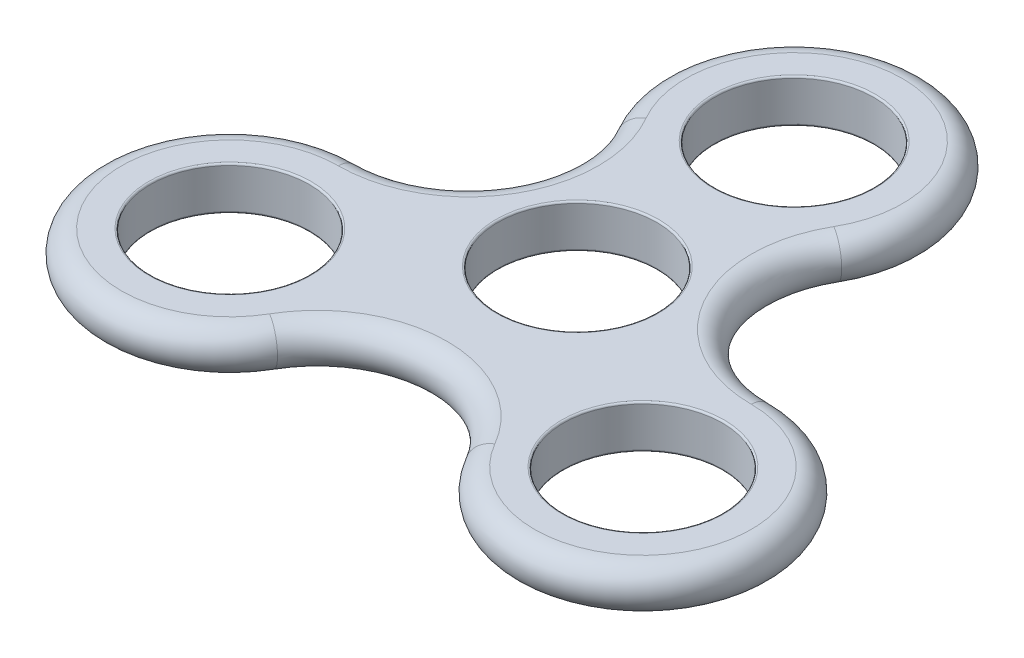
ISO-10303-21;
HEADER;
FILE_DESCRIPTION(('STEP AP214'),'2;1');
FILE_NAME('part.step','',(''),(''),'','','');
FILE_SCHEMA(('AUTOMOTIVE_DESIGN { 1 0 10303 214 1 1 1 1 }'));
ENDSEC;
DATA;
#1=APPLICATION_CONTEXT('core data for automotive mechanical design processes');
#2=APPLICATION_PROTOCOL_DEFINITION('international standard','automotive_design',2000,#1);
#3=PRODUCT_CONTEXT('',#1,'mechanical');
#4=PRODUCT('Part','Part','',(#3));
#5=PRODUCT_RELATED_PRODUCT_CATEGORY('part','',(#4));
#6=PRODUCT_DEFINITION_FORMATION('','',#4);
#7=PRODUCT_DEFINITION_CONTEXT('part definition',#1,'design');
#8=PRODUCT_DEFINITION('design','',#6,#7);
#9=PRODUCT_DEFINITION_SHAPE('','',#8);
#10=(LENGTH_UNIT() NAMED_UNIT(*) SI_UNIT(.MILLI.,.METRE.));
#11=(NAMED_UNIT(*) PLANE_ANGLE_UNIT() SI_UNIT($,.RADIAN.));
#12=(NAMED_UNIT(*) SI_UNIT($,.STERADIAN.) SOLID_ANGLE_UNIT());
#13=UNCERTAINTY_MEASURE_WITH_UNIT(LENGTH_MEASURE(1.E-05),#10,'distance_accuracy_value','');
#14=(GEOMETRIC_REPRESENTATION_CONTEXT(3) GLOBAL_UNCERTAINTY_ASSIGNED_CONTEXT((#13)) GLOBAL_UNIT_ASSIGNED_CONTEXT((#10,
#11,#12)) REPRESENTATION_CONTEXT('',''));
#15=CARTESIAN_POINT('',(0.,0.,0.));
#16=DIRECTION('',(0.,0.,1.));
#17=DIRECTION('',(1.,0.,0.));
#18=AXIS2_PLACEMENT_3D('',#15,#16,#17);
#19=CARTESIAN_POINT('',(0.,3.,-30.));
#20=DIRECTION('',(0.,1.,0.));
#21=DIRECTION('',(0.,0.,1.));
#22=AXIS2_PLACEMENT_3D('',#19,#20,#21);
#23=TOROIDAL_SURFACE('',#22,15.,3.);
#24=CARTESIAN_POINT('',(-12.9903810567666,3.,-22.5));
#25=DIRECTION('',(0.500000000000002,0.,0.866025403784438));
#26=DIRECTION('',(0.866025403784438,0.,-0.500000000000002));
#27=AXIS2_PLACEMENT_3D('',#24,#25,#26);
#28=CIRCLE('',#27,3.);
#29=CARTESIAN_POINT('',(-12.9903810567666,6.,-22.5));
#30=VERTEX_POINT('',#29);
#31=CARTESIAN_POINT('',(-12.9903810567666,0.,-22.5));
#32=VERTEX_POINT('',#31);
#33=EDGE_CURVE('E107',#30,#32,#28,.T.);
#34=ORIENTED_EDGE('',*,*,#33,.F.);
#35=CARTESIAN_POINT('',(0.,6.,-30.));
#36=DIRECTION('',(0.,-1.,0.));
#37=DIRECTION('',(0.,0.,-1.));
#38=AXIS2_PLACEMENT_3D('',#35,#36,#37);
#39=CIRCLE('',#38,15.);
#40=CARTESIAN_POINT('',(12.9903810567666,6.,-22.5));
#41=VERTEX_POINT('',#40);
#42=EDGE_CURVE('E115',#41,#30,#39,.F.);
#43=ORIENTED_EDGE('',*,*,#42,.F.);
#44=CARTESIAN_POINT('',(12.9903810567666,3.,-22.5));
#45=DIRECTION('',(0.500000000000001,0.,-0.866025403784438));
#46=DIRECTION('',(-0.866025403784438,0.,-0.500000000000001));
#47=AXIS2_PLACEMENT_3D('',#44,#45,#46);
#48=CIRCLE('',#47,3.);
#49=CARTESIAN_POINT('',(12.9903810567666,0.,-22.5));
#50=VERTEX_POINT('',#49);
#51=EDGE_CURVE('E96',#41,#50,#48,.T.);
#52=ORIENTED_EDGE('',*,*,#51,.T.);
#53=CARTESIAN_POINT('',(0.,0.,-30.));
#54=DIRECTION('',(0.,-1.,0.));
#55=DIRECTION('',(0.,0.,-1.));
#56=AXIS2_PLACEMENT_3D('',#53,#54,#55);
#57=CIRCLE('',#56,15.);
#58=EDGE_CURVE('E137',#32,#50,#57,.T.);
#59=ORIENTED_EDGE('',*,*,#58,.F.);
#60=EDGE_LOOP('',(#34,#43,#52,#59));
#61=FACE_BOUND('',#60,.T.);
#62=ADVANCED_FACE('F41',(#61),#23,.T.);
#63=CARTESIAN_POINT('',(28.5788383248865,3.,-13.5));
#64=DIRECTION('',(0.,-1.,0.));
#65=DIRECTION('',(0.,0.,-1.));
#66=AXIS2_PLACEMENT_3D('',#63,#64,#65);
#67=TOROIDAL_SURFACE('',#66,18.,3.);
#68=ORIENTED_EDGE('',*,*,#51,.F.);
#69=CARTESIAN_POINT('',(28.5788383248865,6.,-13.5));
#70=DIRECTION('',(0.,-1.,0.));
#71=DIRECTION('',(0.,0.,-1.));
#72=AXIS2_PLACEMENT_3D('',#69,#70,#71);
#73=CIRCLE('',#72,18.);
#74=CARTESIAN_POINT('',(28.5788383248865,6.,4.50000000000004));
#75=VERTEX_POINT('',#74);
#76=EDGE_CURVE('E99',#75,#41,#73,.T.);
#77=ORIENTED_EDGE('',*,*,#76,.F.);
#78=CARTESIAN_POINT('',(28.5788383248865,3.,4.50000000000004));
#79=DIRECTION('',(-1.,0.,0.));
#80=DIRECTION('',(0.,-1.,0.));
#81=AXIS2_PLACEMENT_3D('',#78,#79,#80);
#82=CIRCLE('',#81,3.);
#83=CARTESIAN_POINT('',(28.5788383248865,0.,4.50000000000004));
#84=VERTEX_POINT('',#83);
#85=EDGE_CURVE('E108',#75,#84,#82,.T.);
#86=ORIENTED_EDGE('',*,*,#85,.T.);
#87=CARTESIAN_POINT('',(28.5788383248865,0.,-13.5));
#88=DIRECTION('',(0.,-1.,0.));
#89=DIRECTION('',(0.,0.,-1.));
#90=AXIS2_PLACEMENT_3D('',#87,#88,#89);
#91=CIRCLE('',#90,18.);
#92=EDGE_CURVE('E101',#50,#84,#91,.F.);
#93=ORIENTED_EDGE('',*,*,#92,.F.);
#94=EDGE_LOOP('',(#68,#77,#86,#93));
#95=FACE_BOUND('',#94,.T.);
#96=ADVANCED_FACE('F98',(#95),#67,.T.);
#97=CARTESIAN_POINT('',(28.5788383248865,3.,19.5));
#98=DIRECTION('',(0.,1.,0.));
#99=DIRECTION('',(0.,0.,1.));
#100=AXIS2_PLACEMENT_3D('',#97,#98,#99);
#101=TOROIDAL_SURFACE('',#100,15.,3.);
#102=ORIENTED_EDGE('',*,*,#85,.F.);
#103=CARTESIAN_POINT('',(28.5788383248865,6.,19.5));
#104=DIRECTION('',(0.,-1.,0.));
#105=DIRECTION('',(0.,0.,-1.));
#106=AXIS2_PLACEMENT_3D('',#103,#104,#105);
#107=CIRCLE('',#106,15.);
#108=CARTESIAN_POINT('',(15.5884572681199,6.,27.));
#109=VERTEX_POINT('',#108);
#110=EDGE_CURVE('E118',#109,#75,#107,.F.);
#111=ORIENTED_EDGE('',*,*,#110,.F.);
#112=CARTESIAN_POINT('',(15.5884572681199,3.,27.));
#113=DIRECTION('',(0.499999999999999,0.,0.866025403784439));
#114=DIRECTION('',(0.866025403784439,0.,-0.499999999999999));
#115=AXIS2_PLACEMENT_3D('',#112,#113,#114);
#116=CIRCLE('',#115,3.);
#117=CARTESIAN_POINT('',(15.5884572681199,0.,27.));
#118=VERTEX_POINT('',#117);
#119=EDGE_CURVE('E162',#109,#118,#116,.T.);
#120=ORIENTED_EDGE('',*,*,#119,.T.);
#121=CARTESIAN_POINT('',(28.5788383248865,0.,19.5));
#122=DIRECTION('',(0.,-1.,0.));
#123=DIRECTION('',(0.,0.,-1.));
#124=AXIS2_PLACEMENT_3D('',#121,#122,#123);
#125=CIRCLE('',#124,15.);
#126=EDGE_CURVE('E142',#84,#118,#125,.T.);
#127=ORIENTED_EDGE('',*,*,#126,.F.);
#128=EDGE_LOOP('',(#102,#111,#120,#127));
#129=FACE_BOUND('',#128,.T.);
#130=ADVANCED_FACE('F244',(#129),#101,.T.);
#131=CARTESIAN_POINT('',(0.,3.,36.));
#132=DIRECTION('',(0.,-1.,0.));
#133=DIRECTION('',(0.,0.,-1.));
#134=AXIS2_PLACEMENT_3D('',#131,#132,#133);
#135=TOROIDAL_SURFACE('',#134,18.,3.);
#136=ORIENTED_EDGE('',*,*,#119,.F.);
#137=CARTESIAN_POINT('',(0.,6.,36.));
#138=DIRECTION('',(0.,-1.,0.));
#139=DIRECTION('',(0.,0.,-1.));
#140=AXIS2_PLACEMENT_3D('',#137,#138,#139);
#141=CIRCLE('',#140,18.);
#142=CARTESIAN_POINT('',(-15.5884572681199,6.,27.));
#143=VERTEX_POINT('',#142);
#144=EDGE_CURVE('E127',#143,#109,#141,.T.);
#145=ORIENTED_EDGE('',*,*,#144,.F.);
#146=CARTESIAN_POINT('',(-15.5884572681199,3.,27.));
#147=DIRECTION('',(0.499999999999999,0.,-0.866025403784439));
#148=DIRECTION('',(-0.866025403784439,0.,-0.499999999999999));
#149=AXIS2_PLACEMENT_3D('',#146,#147,#148);
#150=CIRCLE('',#149,3.);
#151=CARTESIAN_POINT('',(-15.5884572681199,0.,27.));
#152=VERTEX_POINT('',#151);
#153=EDGE_CURVE('E65',#143,#152,#150,.T.);
#154=ORIENTED_EDGE('',*,*,#153,.T.);
#155=CARTESIAN_POINT('',(0.,0.,36.));
#156=DIRECTION('',(0.,-1.,0.));
#157=DIRECTION('',(0.,0.,-1.));
#158=AXIS2_PLACEMENT_3D('',#155,#156,#157);
#159=CIRCLE('',#158,18.);
#160=EDGE_CURVE('E146',#118,#152,#159,.F.);
#161=ORIENTED_EDGE('',*,*,#160,.F.);
#162=EDGE_LOOP('',(#136,#145,#154,#161));
#163=FACE_BOUND('',#162,.T.);
#164=ADVANCED_FACE('F314',(#163),#135,.T.);
#165=CARTESIAN_POINT('',(-28.5788383248865,3.,19.5));
#166=DIRECTION('',(0.,1.,0.));
#167=DIRECTION('',(0.,0.,1.));
#168=AXIS2_PLACEMENT_3D('',#165,#166,#167);
#169=TOROIDAL_SURFACE('',#168,15.,3.);
#170=ORIENTED_EDGE('',*,*,#153,.F.);
#171=CARTESIAN_POINT('',(-28.5788383248865,6.,19.5));
#172=DIRECTION('',(0.,-1.,0.));
#173=DIRECTION('',(0.,0.,-1.));
#174=AXIS2_PLACEMENT_3D('',#171,#172,#173);
#175=CIRCLE('',#174,15.);
#176=CARTESIAN_POINT('',(-28.5788383248865,6.,4.50000000000003));
#177=VERTEX_POINT('',#176);
#178=EDGE_CURVE('E130',#177,#143,#175,.F.);
#179=ORIENTED_EDGE('',*,*,#178,.F.);
#180=CARTESIAN_POINT('',(-28.5788383248865,3.,4.50000000000003));
#181=DIRECTION('',(-1.,0.,0.));
#182=DIRECTION('',(0.,0.,1.));
#183=AXIS2_PLACEMENT_3D('',#180,#181,#182);
#184=CIRCLE('',#183,3.);
#185=CARTESIAN_POINT('',(-28.5788383248865,0.,4.50000000000003));
#186=VERTEX_POINT('',#185);
#187=EDGE_CURVE('E57',#177,#186,#184,.T.);
#188=ORIENTED_EDGE('',*,*,#187,.T.);
#189=CARTESIAN_POINT('',(-28.5788383248865,0.,19.5));
#190=DIRECTION('',(0.,-1.,0.));
#191=DIRECTION('',(0.,0.,-1.));
#192=AXIS2_PLACEMENT_3D('',#189,#190,#191);
#193=CIRCLE('',#192,15.);
#194=EDGE_CURVE('E150',#152,#186,#193,.T.);
#195=ORIENTED_EDGE('',*,*,#194,.F.);
#196=EDGE_LOOP('',(#170,#179,#188,#195));
#197=FACE_BOUND('',#196,.T.);
#198=ADVANCED_FACE('F307',(#197),#169,.T.);
#199=CARTESIAN_POINT('',(-28.5788383248865,3.,-13.5));
#200=DIRECTION('',(0.,-1.,0.));
#201=DIRECTION('',(0.,0.,-1.));
#202=AXIS2_PLACEMENT_3D('',#199,#200,#201);
#203=TOROIDAL_SURFACE('',#202,18.,3.);
#204=CARTESIAN_POINT('',(-28.5788383248865,6.,-13.5));
#205=DIRECTION('',(0.,-1.,0.));
#206=DIRECTION('',(0.,0.,-1.));
#207=AXIS2_PLACEMENT_3D('',#204,#205,#206);
#208=CIRCLE('',#207,18.);
#209=EDGE_CURVE('E134',#30,#177,#208,.T.);
#210=ORIENTED_EDGE('',*,*,#209,.F.);
#211=ORIENTED_EDGE('',*,*,#33,.T.);
#212=CARTESIAN_POINT('',(-28.5788383248865,0.,-13.5));
#213=DIRECTION('',(0.,-1.,0.));
#214=DIRECTION('',(0.,0.,-1.));
#215=AXIS2_PLACEMENT_3D('',#212,#213,#214);
#216=CIRCLE('',#215,18.);
#217=EDGE_CURVE('E154',#186,#32,#216,.F.);
#218=ORIENTED_EDGE('',*,*,#217,.F.);
#219=ORIENTED_EDGE('',*,*,#187,.F.);
#220=EDGE_LOOP('',(#210,#211,#218,#219));
#221=FACE_BOUND('',#220,.T.);
#222=ADVANCED_FACE('F298',(#221),#203,.T.);
#223=CARTESIAN_POINT('',(-28.5788383248865,6.,3.00000000000003));
#224=DIRECTION('',(0.,-1.,0.));
#225=DIRECTION('',(0.,0.,-1.));
#226=AXIS2_PLACEMENT_3D('',#223,#224,#225);
#227=PLANE('',#226);
#228=CARTESIAN_POINT('',(-28.5788383248865,6.,19.5));
#229=DIRECTION('',(0.,-1.,0.));
#230=DIRECTION('',(0.,0.,-1.));
#231=AXIS2_PLACEMENT_3D('',#228,#229,#230);
#232=CIRCLE('',#231,11.25);
#233=CARTESIAN_POINT('',(-28.5788383248865,6.,8.25000000000003));
#234=VERTEX_POINT('',#233);
#235=EDGE_CURVE('E205',#234,#234,#232,.T.);
#236=ORIENTED_EDGE('',*,*,#235,.T.);
#237=EDGE_LOOP('',(#236));
#238=FACE_BOUND('',#237,.T.);
#239=CARTESIAN_POINT('',(28.5788383248865,6.,19.5));
#240=DIRECTION('',(0.,-1.,0.));
#241=DIRECTION('',(0.,0.,-1.));
#242=AXIS2_PLACEMENT_3D('',#239,#240,#241);
#243=CIRCLE('',#242,11.25);
#244=CARTESIAN_POINT('',(28.5788383248865,6.,8.25000000000003));
#245=VERTEX_POINT('',#244);
#246=EDGE_CURVE('E201',#245,#245,#243,.T.);
#247=ORIENTED_EDGE('',*,*,#246,.T.);
#248=EDGE_LOOP('',(#247));
#249=FACE_BOUND('',#248,.T.);
#250=CARTESIAN_POINT('',(0.,6.,0.));
#251=DIRECTION('',(0.,-1.,0.));
#252=DIRECTION('',(0.,0.,-1.));
#253=AXIS2_PLACEMENT_3D('',#250,#251,#252);
#254=CIRCLE('',#253,11.25);
#255=CARTESIAN_POINT('',(0.,6.,-11.25));
#256=VERTEX_POINT('',#255);
#257=EDGE_CURVE('E197',#256,#256,#254,.T.);
#258=ORIENTED_EDGE('',*,*,#257,.T.);
#259=EDGE_LOOP('',(#258));
#260=FACE_BOUND('',#259,.T.);
#261=CARTESIAN_POINT('',(0.,6.,-30.));
#262=DIRECTION('',(0.,-1.,0.));
#263=DIRECTION('',(0.,0.,-1.));
#264=AXIS2_PLACEMENT_3D('',#261,#262,#263);
#265=CIRCLE('',#264,11.250000000002);
#266=CARTESIAN_POINT('',(0.,6.,-41.250000000002));
#267=VERTEX_POINT('',#266);
#268=EDGE_CURVE('E193',#267,#267,#265,.T.);
#269=ORIENTED_EDGE('',*,*,#268,.T.);
#270=EDGE_LOOP('',(#269));
#271=FACE_BOUND('',#270,.T.);
#272=ORIENTED_EDGE('',*,*,#42,.T.);
#273=ORIENTED_EDGE('',*,*,#209,.T.);
#274=ORIENTED_EDGE('',*,*,#178,.T.);
#275=ORIENTED_EDGE('',*,*,#144,.T.);
#276=ORIENTED_EDGE('',*,*,#110,.T.);
#277=ORIENTED_EDGE('',*,*,#76,.T.);
#278=EDGE_LOOP('',(#272,#273,#274,#275,#276,#277));
#279=FACE_BOUND('',#278,.T.);
#280=ADVANCED_FACE('F113',(#238,#249,#260,#271,#279),#227,.F.);
#281=CARTESIAN_POINT('',(-28.5788383248865,0.,3.00000000000003));
#282=DIRECTION('',(0.,-1.,0.));
#283=DIRECTION('',(0.,0.,-1.));
#284=AXIS2_PLACEMENT_3D('',#281,#282,#283);
#285=PLANE('',#284);
#286=CARTESIAN_POINT('',(-28.5788383248865,0.,19.5));
#287=DIRECTION('',(0.,-1.,0.));
#288=DIRECTION('',(0.,0.,-1.));
#289=AXIS2_PLACEMENT_3D('',#286,#287,#288);
#290=CIRCLE('',#289,11.25);
#291=CARTESIAN_POINT('',(-28.5788383248865,0.,8.25000000000003));
#292=VERTEX_POINT('',#291);
#293=EDGE_CURVE('E181',#292,#292,#290,.F.);
#294=ORIENTED_EDGE('',*,*,#293,.T.);
#295=EDGE_LOOP('',(#294));
#296=FACE_BOUND('',#295,.T.);
#297=CARTESIAN_POINT('',(28.5788383248865,0.,19.5));
#298=DIRECTION('',(0.,-1.,0.));
#299=DIRECTION('',(0.,0.,-1.));
#300=AXIS2_PLACEMENT_3D('',#297,#298,#299);
#301=CIRCLE('',#300,11.25);
#302=CARTESIAN_POINT('',(28.5788383248865,0.,8.25000000000003));
#303=VERTEX_POINT('',#302);
#304=EDGE_CURVE('E177',#303,#303,#301,.F.);
#305=ORIENTED_EDGE('',*,*,#304,.T.);
#306=EDGE_LOOP('',(#305));
#307=FACE_BOUND('',#306,.T.);
#308=CARTESIAN_POINT('',(0.,0.,0.));
#309=DIRECTION('',(0.,-1.,0.));
#310=DIRECTION('',(0.,0.,-1.));
#311=AXIS2_PLACEMENT_3D('',#308,#309,#310);
#312=CIRCLE('',#311,11.25);
#313=CARTESIAN_POINT('',(0.,0.,-11.25));
#314=VERTEX_POINT('',#313);
#315=EDGE_CURVE('E173',#314,#314,#312,.F.);
#316=ORIENTED_EDGE('',*,*,#315,.T.);
#317=EDGE_LOOP('',(#316));
#318=FACE_BOUND('',#317,.T.);
#319=CARTESIAN_POINT('',(0.,0.,-30.));
#320=DIRECTION('',(0.,-1.,0.));
#321=DIRECTION('',(0.,0.,-1.));
#322=AXIS2_PLACEMENT_3D('',#319,#320,#321);
#323=CIRCLE('',#322,11.250000000002);
#324=CARTESIAN_POINT('',(0.,0.,-41.250000000002));
#325=VERTEX_POINT('',#324);
#326=EDGE_CURVE('E169',#325,#325,#323,.F.);
#327=ORIENTED_EDGE('',*,*,#326,.T.);
#328=EDGE_LOOP('',(#327));
#329=FACE_BOUND('',#328,.T.);
#330=ORIENTED_EDGE('',*,*,#194,.T.);
#331=ORIENTED_EDGE('',*,*,#217,.T.);
#332=ORIENTED_EDGE('',*,*,#58,.T.);
#333=ORIENTED_EDGE('',*,*,#92,.T.);
#334=ORIENTED_EDGE('',*,*,#126,.T.);
#335=ORIENTED_EDGE('',*,*,#160,.T.);
#336=EDGE_LOOP('',(#330,#331,#332,#333,#334,#335));
#337=FACE_BOUND('',#336,.T.);
#338=ADVANCED_FACE('F283',(#296,#307,#318,#329,#337),#285,.T.);
#339=CARTESIAN_POINT('',(0.,6.,0.));
#340=DIRECTION('',(0.,-1.,0.));
#341=DIRECTION('',(0.,0.,-1.));
#342=AXIS2_PLACEMENT_3D('',#339,#340,#341);
#343=CYLINDRICAL_SURFACE('',#342,11.);
#344=CARTESIAN_POINT('',(0.,0.25,0.));
#345=DIRECTION('',(0.,-1.,0.));
#346=DIRECTION('',(0.,0.,-1.));
#347=AXIS2_PLACEMENT_3D('',#344,#345,#346);
#348=CIRCLE('',#347,11.);
#349=CARTESIAN_POINT('',(0.,0.25,-11.));
#350=VERTEX_POINT('',#349);
#351=EDGE_CURVE('E221',#350,#350,#348,.T.);
#352=ORIENTED_EDGE('',*,*,#351,.T.);
#353=EDGE_LOOP('',(#352));
#354=FACE_BOUND('',#353,.T.);
#355=CARTESIAN_POINT('',(0.,5.75,0.));
#356=DIRECTION('',(0.,-1.,0.));
#357=DIRECTION('',(0.,0.,-1.));
#358=AXIS2_PLACEMENT_3D('',#355,#356,#357);
#359=CIRCLE('',#358,11.);
#360=CARTESIAN_POINT('',(0.,5.75,-11.));
#361=VERTEX_POINT('',#360);
#362=EDGE_CURVE('E217',#361,#361,#359,.F.);
#363=ORIENTED_EDGE('',*,*,#362,.T.);
#364=EDGE_LOOP('',(#363));
#365=FACE_BOUND('',#364,.T.);
#366=ADVANCED_FACE('F281',(#354,#365),#343,.F.);
#367=CARTESIAN_POINT('',(0.,6.,-30.));
#368=DIRECTION('',(0.,-1.,0.));
#369=DIRECTION('',(0.,0.,-1.));
#370=AXIS2_PLACEMENT_3D('',#367,#368,#369);
#371=CYLINDRICAL_SURFACE('',#370,11.000000000002);
#372=CARTESIAN_POINT('',(0.,0.25,-30.));
#373=DIRECTION('',(0.,-1.,0.));
#374=DIRECTION('',(0.,0.,-1.));
#375=AXIS2_PLACEMENT_3D('',#372,#373,#374);
#376=CIRCLE('',#375,11.000000000002);
#377=CARTESIAN_POINT('',(0.,0.25,-41.000000000002));
#378=VERTEX_POINT('',#377);
#379=EDGE_CURVE('E11',#378,#378,#376,.T.);
#380=ORIENTED_EDGE('',*,*,#379,.T.);
#381=EDGE_LOOP('',(#380));
#382=FACE_BOUND('',#381,.T.);
#383=CARTESIAN_POINT('',(0.,5.75,-30.));
#384=DIRECTION('',(0.,-1.,0.));
#385=DIRECTION('',(0.,0.,-1.));
#386=AXIS2_PLACEMENT_3D('',#383,#384,#385);
#387=CIRCLE('',#386,11.000000000002);
#388=CARTESIAN_POINT('',(0.,5.75,-41.000000000002));
#389=VERTEX_POINT('',#388);
#390=EDGE_CURVE('E50',#389,#389,#387,.F.);
#391=ORIENTED_EDGE('',*,*,#390,.T.);
#392=EDGE_LOOP('',(#391));
#393=FACE_BOUND('',#392,.T.);
#394=ADVANCED_FACE('F228',(#382,#393),#371,.F.);
#395=CARTESIAN_POINT('',(28.5788383248865,6.,19.5));
#396=DIRECTION('',(0.,-1.,0.));
#397=DIRECTION('',(0.,0.,-1.));
#398=AXIS2_PLACEMENT_3D('',#395,#396,#397);
#399=CYLINDRICAL_SURFACE('',#398,11.);
#400=CARTESIAN_POINT('',(28.5788383248865,0.25,19.5));
#401=DIRECTION('',(0.,-1.,0.));
#402=DIRECTION('',(0.,0.,-1.));
#403=AXIS2_PLACEMENT_3D('',#400,#401,#402);
#404=CIRCLE('',#403,11.);
#405=CARTESIAN_POINT('',(28.5788383248865,0.25,8.50000000000003));
#406=VERTEX_POINT('',#405);
#407=EDGE_CURVE('E213',#406,#406,#404,.T.);
#408=ORIENTED_EDGE('',*,*,#407,.T.);
#409=EDGE_LOOP('',(#408));
#410=FACE_BOUND('',#409,.T.);
#411=CARTESIAN_POINT('',(28.5788383248865,5.75,19.5));
#412=DIRECTION('',(0.,-1.,0.));
#413=DIRECTION('',(0.,0.,-1.));
#414=AXIS2_PLACEMENT_3D('',#411,#412,#413);
#415=CIRCLE('',#414,11.);
#416=CARTESIAN_POINT('',(28.5788383248865,5.75,8.50000000000003));
#417=VERTEX_POINT('',#416);
#418=EDGE_CURVE('E209',#417,#417,#415,.F.);
#419=ORIENTED_EDGE('',*,*,#418,.T.);
#420=EDGE_LOOP('',(#419));
#421=FACE_BOUND('',#420,.T.);
#422=ADVANCED_FACE('F290',(#410,#421),#399,.F.);
#423=CARTESIAN_POINT('',(-28.5788383248865,6.,19.5));
#424=DIRECTION('',(0.,-1.,0.));
#425=DIRECTION('',(0.,0.,-1.));
#426=AXIS2_PLACEMENT_3D('',#423,#424,#425);
#427=CYLINDRICAL_SURFACE('',#426,11.);
#428=CARTESIAN_POINT('',(-28.5788383248865,0.25,19.5));
#429=DIRECTION('',(0.,-1.,0.));
#430=DIRECTION('',(0.,0.,-1.));
#431=AXIS2_PLACEMENT_3D('',#428,#429,#430);
#432=CIRCLE('',#431,11.);
#433=CARTESIAN_POINT('',(-28.5788383248865,0.25,8.50000000000003));
#434=VERTEX_POINT('',#433);
#435=EDGE_CURVE('E189',#434,#434,#432,.T.);
#436=ORIENTED_EDGE('',*,*,#435,.T.);
#437=EDGE_LOOP('',(#436));
#438=FACE_BOUND('',#437,.T.);
#439=CARTESIAN_POINT('',(-28.5788383248865,5.75,19.5));
#440=DIRECTION('',(0.,-1.,0.));
#441=DIRECTION('',(0.,0.,-1.));
#442=AXIS2_PLACEMENT_3D('',#439,#440,#441);
#443=CIRCLE('',#442,11.);
#444=CARTESIAN_POINT('',(-28.5788383248865,5.75,8.50000000000003));
#445=VERTEX_POINT('',#444);
#446=EDGE_CURVE('E185',#445,#445,#443,.F.);
#447=ORIENTED_EDGE('',*,*,#446,.T.);
#448=EDGE_LOOP('',(#447));
#449=FACE_BOUND('',#448,.T.);
#450=ADVANCED_FACE('F256',(#438,#449),#427,.F.);
#451=CARTESIAN_POINT('',(-28.5788383248865,0.25,19.5));
#452=DIRECTION('',(0.,-1.,0.));
#453=DIRECTION('',(0.,0.,-1.));
#454=AXIS2_PLACEMENT_3D('',#451,#452,#453);
#455=TOROIDAL_SURFACE('',#454,11.25,0.25);
#456=ORIENTED_EDGE('',*,*,#435,.F.);
#457=EDGE_LOOP('',(#456));
#458=FACE_BOUND('',#457,.T.);
#459=ORIENTED_EDGE('',*,*,#293,.F.);
#460=EDGE_LOOP('',(#459));
#461=FACE_BOUND('',#460,.T.);
#462=ADVANCED_FACE('F252',(#458,#461),#455,.T.);
#463=CARTESIAN_POINT('',(-28.5788383248865,5.75,19.5));
#464=DIRECTION('',(0.,-1.,0.));
#465=DIRECTION('',(0.,0.,-1.));
#466=AXIS2_PLACEMENT_3D('',#463,#464,#465);
#467=TOROIDAL_SURFACE('',#466,11.25,0.25);
#468=ORIENTED_EDGE('',*,*,#235,.F.);
#469=EDGE_LOOP('',(#468));
#470=FACE_BOUND('',#469,.T.);
#471=ORIENTED_EDGE('',*,*,#446,.F.);
#472=EDGE_LOOP('',(#471));
#473=FACE_BOUND('',#472,.T.);
#474=ADVANCED_FACE('F255',(#470,#473),#467,.T.);
#475=CARTESIAN_POINT('',(28.5788383248865,0.25,19.5));
#476=DIRECTION('',(0.,-1.,0.));
#477=DIRECTION('',(0.,0.,-1.));
#478=AXIS2_PLACEMENT_3D('',#475,#476,#477);
#479=TOROIDAL_SURFACE('',#478,11.25,0.25);
#480=ORIENTED_EDGE('',*,*,#407,.F.);
#481=EDGE_LOOP('',(#480));
#482=FACE_BOUND('',#481,.T.);
#483=ORIENTED_EDGE('',*,*,#304,.F.);
#484=EDGE_LOOP('',(#483));
#485=FACE_BOUND('',#484,.T.);
#486=ADVANCED_FACE('F260',(#482,#485),#479,.T.);
#487=CARTESIAN_POINT('',(28.5788383248865,5.75,19.5));
#488=DIRECTION('',(0.,-1.,0.));
#489=DIRECTION('',(0.,0.,-1.));
#490=AXIS2_PLACEMENT_3D('',#487,#488,#489);
#491=TOROIDAL_SURFACE('',#490,11.25,0.25);
#492=ORIENTED_EDGE('',*,*,#246,.F.);
#493=EDGE_LOOP('',(#492));
#494=FACE_BOUND('',#493,.T.);
#495=ORIENTED_EDGE('',*,*,#418,.F.);
#496=EDGE_LOOP('',(#495));
#497=FACE_BOUND('',#496,.T.);
#498=ADVANCED_FACE('F264',(#494,#497),#491,.T.);
#499=CARTESIAN_POINT('',(0.,0.25,0.));
#500=DIRECTION('',(0.,-1.,0.));
#501=DIRECTION('',(0.,0.,-1.));
#502=AXIS2_PLACEMENT_3D('',#499,#500,#501);
#503=TOROIDAL_SURFACE('',#502,11.25,0.25);
#504=ORIENTED_EDGE('',*,*,#351,.F.);
#505=EDGE_LOOP('',(#504));
#506=FACE_BOUND('',#505,.T.);
#507=ORIENTED_EDGE('',*,*,#315,.F.);
#508=EDGE_LOOP('',(#507));
#509=FACE_BOUND('',#508,.T.);
#510=ADVANCED_FACE('F268',(#506,#509),#503,.T.);
#511=CARTESIAN_POINT('',(0.,5.75,0.));
#512=DIRECTION('',(0.,-1.,0.));
#513=DIRECTION('',(0.,0.,-1.));
#514=AXIS2_PLACEMENT_3D('',#511,#512,#513);
#515=TOROIDAL_SURFACE('',#514,11.25,0.25);
#516=ORIENTED_EDGE('',*,*,#257,.F.);
#517=EDGE_LOOP('',(#516));
#518=FACE_BOUND('',#517,.T.);
#519=ORIENTED_EDGE('',*,*,#362,.F.);
#520=EDGE_LOOP('',(#519));
#521=FACE_BOUND('',#520,.T.);
#522=ADVANCED_FACE('F236',(#518,#521),#515,.T.);
#523=CARTESIAN_POINT('',(0.,0.25,-30.));
#524=DIRECTION('',(0.,-1.,0.));
#525=DIRECTION('',(0.,0.,-1.));
#526=AXIS2_PLACEMENT_3D('',#523,#524,#525);
#527=TOROIDAL_SURFACE('',#526,11.250000000002,0.25);
#528=ORIENTED_EDGE('',*,*,#379,.F.);
#529=EDGE_LOOP('',(#528));
#530=FACE_BOUND('',#529,.T.);
#531=ORIENTED_EDGE('',*,*,#326,.F.);
#532=EDGE_LOOP('',(#531));
#533=FACE_BOUND('',#532,.T.);
#534=ADVANCED_FACE('F231',(#530,#533),#527,.T.);
#535=CARTESIAN_POINT('',(0.,5.75,-30.));
#536=DIRECTION('',(0.,-1.,0.));
#537=DIRECTION('',(0.,0.,-1.));
#538=AXIS2_PLACEMENT_3D('',#535,#536,#537);
#539=TOROIDAL_SURFACE('',#538,11.250000000002,0.25);
#540=ORIENTED_EDGE('',*,*,#268,.F.);
#541=EDGE_LOOP('',(#540));
#542=FACE_BOUND('',#541,.T.);
#543=ORIENTED_EDGE('',*,*,#390,.F.);
#544=EDGE_LOOP('',(#543));
#545=FACE_BOUND('',#544,.T.);
#546=ADVANCED_FACE('F43',(#542,#545),#539,.T.);
#547=CLOSED_SHELL('',(#62,#96,#130,#164,#198,#222,#280,#338,#366,#394,#422,#450,#462,#474,#486,
#498,#510,#522,#534,#546));
#548=MANIFOLD_SOLID_BREP('B2',#547);
#549=ADVANCED_BREP_SHAPE_REPRESENTATION('',(#18,#548),#14);
#550=SHAPE_DEFINITION_REPRESENTATION(#9,#549);
ENDSEC;
END-ISO-10303-21;
